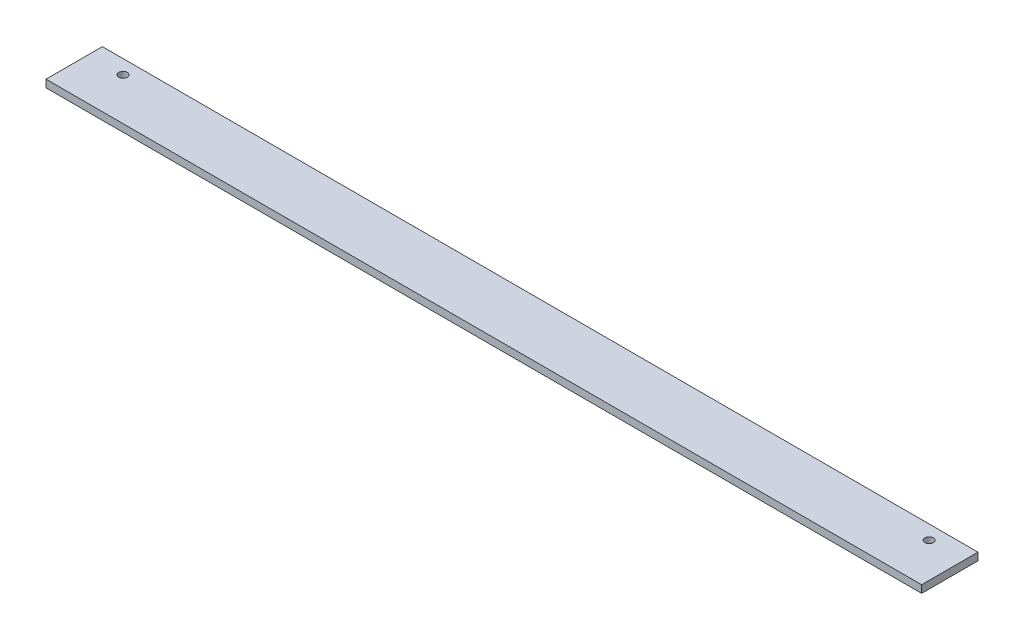
ISO-10303-21;
HEADER;
FILE_DESCRIPTION(('STEP AP214'),'2;1');
FILE_NAME('part.step','',(''),(''),'','','');
FILE_SCHEMA(('AUTOMOTIVE_DESIGN { 1 0 10303 214 1 1 1 1 }'));
ENDSEC;
DATA;
#1=APPLICATION_CONTEXT('core data for automotive mechanical design processes');
#2=APPLICATION_PROTOCOL_DEFINITION('international standard','automotive_design',2000,#1);
#3=PRODUCT_CONTEXT('',#1,'mechanical');
#4=PRODUCT('Part','Part','',(#3));
#5=PRODUCT_RELATED_PRODUCT_CATEGORY('part','',(#4));
#6=PRODUCT_DEFINITION_FORMATION('','',#4);
#7=PRODUCT_DEFINITION_CONTEXT('part definition',#1,'design');
#8=PRODUCT_DEFINITION('design','',#6,#7);
#9=PRODUCT_DEFINITION_SHAPE('','',#8);
#10=(LENGTH_UNIT() NAMED_UNIT(*) SI_UNIT(.MILLI.,.METRE.));
#11=(NAMED_UNIT(*) PLANE_ANGLE_UNIT() SI_UNIT($,.RADIAN.));
#12=(NAMED_UNIT(*) SI_UNIT($,.STERADIAN.) SOLID_ANGLE_UNIT());
#13=UNCERTAINTY_MEASURE_WITH_UNIT(LENGTH_MEASURE(1.E-05),#10,'distance_accuracy_value','');
#14=(GEOMETRIC_REPRESENTATION_CONTEXT(3) GLOBAL_UNCERTAINTY_ASSIGNED_CONTEXT((#13)) GLOBAL_UNIT_ASSIGNED_CONTEXT((#10,
#11,#12)) REPRESENTATION_CONTEXT('',''));
#15=CARTESIAN_POINT('',(0.,0.,0.));
#16=DIRECTION('',(0.,0.,1.));
#17=DIRECTION('',(1.,0.,0.));
#18=AXIS2_PLACEMENT_3D('',#15,#16,#17);
#19=CARTESIAN_POINT('',(466.,-2.,-15.));
#20=DIRECTION('',(0.,0.,1.));
#21=DIRECTION('',(1.,0.,0.));
#22=AXIS2_PLACEMENT_3D('',#19,#20,#21);
#23=PLANE('',#22);
#24=DIRECTION('',(0.,1.,0.));
#25=VECTOR('',#24,1.);
#26=CARTESIAN_POINT('',(0.,-2.,-15.));
#27=LINE('',#26,#25);
#28=CARTESIAN_POINT('',(0.,-2.,-15.));
#29=VERTEX_POINT('',#28);
#30=CARTESIAN_POINT('',(0.,2.,-15.));
#31=VERTEX_POINT('',#30);
#32=EDGE_CURVE('E98',#29,#31,#27,.T.);
#33=ORIENTED_EDGE('',*,*,#32,.T.);
#34=DIRECTION('',(-1.,0.,0.));
#35=VECTOR('',#34,1.);
#36=CARTESIAN_POINT('',(466.,2.,-15.));
#37=LINE('',#36,#35);
#38=CARTESIAN_POINT('',(466.,2.,-15.));
#39=VERTEX_POINT('',#38);
#40=EDGE_CURVE('E11',#39,#31,#37,.T.);
#41=ORIENTED_EDGE('',*,*,#40,.F.);
#42=DIRECTION('',(0.,1.,0.));
#43=VECTOR('',#42,1.);
#44=CARTESIAN_POINT('',(466.,-2.,-15.));
#45=LINE('',#44,#43);
#46=CARTESIAN_POINT('',(466.,-2.,-15.));
#47=VERTEX_POINT('',#46);
#48=EDGE_CURVE('E86',#47,#39,#45,.T.);
#49=ORIENTED_EDGE('',*,*,#48,.F.);
#50=DIRECTION('',(-1.,0.,0.));
#51=VECTOR('',#50,1.);
#52=CARTESIAN_POINT('',(466.,-2.,-15.));
#53=LINE('',#52,#51);
#54=EDGE_CURVE('E94',#47,#29,#53,.T.);
#55=ORIENTED_EDGE('',*,*,#54,.T.);
#56=EDGE_LOOP('',(#33,#41,#49,#55));
#57=FACE_BOUND('',#56,.T.);
#58=ADVANCED_FACE('F35',(#57),#23,.F.);
#59=CARTESIAN_POINT('',(466.,2.,15.));
#60=DIRECTION('',(0.,-1.,0.));
#61=DIRECTION('',(0.,0.,-1.));
#62=AXIS2_PLACEMENT_3D('',#59,#60,#61);
#63=PLANE('',#62);
#64=CARTESIAN_POINT('',(18.5,2.,-7.5));
#65=DIRECTION('',(0.,1.,0.));
#66=DIRECTION('',(0.,0.,1.));
#67=AXIS2_PLACEMENT_3D('',#64,#65,#66);
#68=CIRCLE('',#67,2.25);
#69=CARTESIAN_POINT('',(18.5,2.,-5.25));
#70=VERTEX_POINT('',#69);
#71=EDGE_CURVE('E118',#70,#70,#68,.T.);
#72=ORIENTED_EDGE('',*,*,#71,.F.);
#73=EDGE_LOOP('',(#72));
#74=FACE_BOUND('',#73,.T.);
#75=CARTESIAN_POINT('',(447.5,2.,-7.5));
#76=DIRECTION('',(0.,1.,0.));
#77=DIRECTION('',(0.,0.,1.));
#78=AXIS2_PLACEMENT_3D('',#75,#76,#77);
#79=CIRCLE('',#78,2.24999999999995);
#80=CARTESIAN_POINT('',(447.5,2.,-5.25000000000005));
#81=VERTEX_POINT('',#80);
#82=EDGE_CURVE('E112',#81,#81,#79,.T.);
#83=ORIENTED_EDGE('',*,*,#82,.F.);
#84=EDGE_LOOP('',(#83));
#85=FACE_BOUND('',#84,.T.);
#86=DIRECTION('',(0.,0.,1.));
#87=VECTOR('',#86,1.);
#88=CARTESIAN_POINT('',(0.,2.,15.));
#89=LINE('',#88,#87);
#90=CARTESIAN_POINT('',(0.,2.,15.));
#91=VERTEX_POINT('',#90);
#92=EDGE_CURVE('E90',#31,#91,#89,.T.);
#93=ORIENTED_EDGE('',*,*,#92,.T.);
#94=DIRECTION('',(-1.,0.,0.));
#95=VECTOR('',#94,1.);
#96=CARTESIAN_POINT('',(466.,2.,15.));
#97=LINE('',#96,#95);
#98=CARTESIAN_POINT('',(466.,2.,15.));
#99=VERTEX_POINT('',#98);
#100=EDGE_CURVE('E43',#99,#91,#97,.T.);
#101=ORIENTED_EDGE('',*,*,#100,.F.);
#102=DIRECTION('',(0.,0.,1.));
#103=VECTOR('',#102,1.);
#104=CARTESIAN_POINT('',(466.,2.,15.));
#105=LINE('',#104,#103);
#106=EDGE_CURVE('E81',#39,#99,#105,.T.);
#107=ORIENTED_EDGE('',*,*,#106,.F.);
#108=ORIENTED_EDGE('',*,*,#40,.T.);
#109=EDGE_LOOP('',(#93,#101,#107,#108));
#110=FACE_BOUND('',#109,.T.);
#111=ADVANCED_FACE('F89',(#74,#85,#110),#63,.F.);
#112=CARTESIAN_POINT('',(466.,-2.,15.));
#113=DIRECTION('',(0.,0.,-1.));
#114=DIRECTION('',(-1.,0.,0.));
#115=AXIS2_PLACEMENT_3D('',#112,#113,#114);
#116=PLANE('',#115);
#117=DIRECTION('',(0.,-1.,0.));
#118=VECTOR('',#117,1.);
#119=CARTESIAN_POINT('',(0.,-2.,15.));
#120=LINE('',#119,#118);
#121=CARTESIAN_POINT('',(0.,-2.,15.));
#122=VERTEX_POINT('',#121);
#123=EDGE_CURVE('E68',#91,#122,#120,.T.);
#124=ORIENTED_EDGE('',*,*,#123,.T.);
#125=DIRECTION('',(-1.,0.,0.));
#126=VECTOR('',#125,1.);
#127=CARTESIAN_POINT('',(466.,-2.,15.));
#128=LINE('',#127,#126);
#129=CARTESIAN_POINT('',(466.,-2.,15.));
#130=VERTEX_POINT('',#129);
#131=EDGE_CURVE('E91',#130,#122,#128,.T.);
#132=ORIENTED_EDGE('',*,*,#131,.F.);
#133=DIRECTION('',(0.,-1.,0.));
#134=VECTOR('',#133,1.);
#135=CARTESIAN_POINT('',(466.,-2.,15.));
#136=LINE('',#135,#134);
#137=EDGE_CURVE('E84',#99,#130,#136,.T.);
#138=ORIENTED_EDGE('',*,*,#137,.F.);
#139=ORIENTED_EDGE('',*,*,#100,.T.);
#140=EDGE_LOOP('',(#124,#132,#138,#139));
#141=FACE_BOUND('',#140,.T.);
#142=ADVANCED_FACE('F92',(#141),#116,.F.);
#143=CARTESIAN_POINT('',(466.,-2.,15.));
#144=DIRECTION('',(0.,1.,0.));
#145=DIRECTION('',(0.,0.,1.));
#146=AXIS2_PLACEMENT_3D('',#143,#144,#145);
#147=PLANE('',#146);
#148=CARTESIAN_POINT('',(18.5,-2.,-7.5));
#149=DIRECTION('',(0.,1.,0.));
#150=DIRECTION('',(0.,0.,1.));
#151=AXIS2_PLACEMENT_3D('',#148,#149,#150);
#152=CIRCLE('',#151,2.25);
#153=CARTESIAN_POINT('',(18.5,-2.,-5.25));
#154=VERTEX_POINT('',#153);
#155=EDGE_CURVE('E101',#154,#154,#152,.T.);
#156=ORIENTED_EDGE('',*,*,#155,.T.);
#157=EDGE_LOOP('',(#156));
#158=FACE_BOUND('',#157,.T.);
#159=CARTESIAN_POINT('',(447.5,-2.,-7.5));
#160=DIRECTION('',(0.,1.,0.));
#161=DIRECTION('',(0.,0.,1.));
#162=AXIS2_PLACEMENT_3D('',#159,#160,#161);
#163=CIRCLE('',#162,2.24999999999995);
#164=CARTESIAN_POINT('',(447.5,-2.,-5.25000000000005));
#165=VERTEX_POINT('',#164);
#166=EDGE_CURVE('E115',#165,#165,#163,.T.);
#167=ORIENTED_EDGE('',*,*,#166,.T.);
#168=EDGE_LOOP('',(#167));
#169=FACE_BOUND('',#168,.T.);
#170=DIRECTION('',(0.,0.,-1.));
#171=VECTOR('',#170,1.);
#172=CARTESIAN_POINT('',(0.,-2.,15.));
#173=LINE('',#172,#171);
#174=EDGE_CURVE('E74',#122,#29,#173,.T.);
#175=ORIENTED_EDGE('',*,*,#174,.T.);
#176=ORIENTED_EDGE('',*,*,#54,.F.);
#177=DIRECTION('',(0.,0.,-1.));
#178=VECTOR('',#177,1.);
#179=CARTESIAN_POINT('',(466.,-2.,15.));
#180=LINE('',#179,#178);
#181=EDGE_CURVE('E51',#130,#47,#180,.T.);
#182=ORIENTED_EDGE('',*,*,#181,.F.);
#183=ORIENTED_EDGE('',*,*,#131,.T.);
#184=EDGE_LOOP('',(#175,#176,#182,#183));
#185=FACE_BOUND('',#184,.T.);
#186=ADVANCED_FACE('F106',(#158,#169,#185),#147,.F.);
#187=CARTESIAN_POINT('',(466.,0.,0.));
#188=DIRECTION('',(-1.,0.,0.));
#189=DIRECTION('',(0.,0.,1.));
#190=AXIS2_PLACEMENT_3D('',#187,#188,#189);
#191=PLANE('',#190);
#192=ORIENTED_EDGE('',*,*,#48,.T.);
#193=ORIENTED_EDGE('',*,*,#106,.T.);
#194=ORIENTED_EDGE('',*,*,#137,.T.);
#195=ORIENTED_EDGE('',*,*,#181,.T.);
#196=EDGE_LOOP('',(#192,#193,#194,#195));
#197=FACE_BOUND('',#196,.T.);
#198=ADVANCED_FACE('F82',(#197),#191,.F.);
#199=CARTESIAN_POINT('',(0.,0.,0.));
#200=DIRECTION('',(-1.,0.,0.));
#201=DIRECTION('',(0.,0.,1.));
#202=AXIS2_PLACEMENT_3D('',#199,#200,#201);
#203=PLANE('',#202);
#204=ORIENTED_EDGE('',*,*,#32,.F.);
#205=ORIENTED_EDGE('',*,*,#174,.F.);
#206=ORIENTED_EDGE('',*,*,#123,.F.);
#207=ORIENTED_EDGE('',*,*,#92,.F.);
#208=EDGE_LOOP('',(#204,#205,#206,#207));
#209=FACE_BOUND('',#208,.T.);
#210=ADVANCED_FACE('F109',(#209),#203,.T.);
#211=CARTESIAN_POINT('',(447.5,-2.,-7.5));
#212=DIRECTION('',(0.,1.,0.));
#213=DIRECTION('',(0.,0.,1.));
#214=AXIS2_PLACEMENT_3D('',#211,#212,#213);
#215=CYLINDRICAL_SURFACE('',#214,2.24999999999995);
#216=ORIENTED_EDGE('',*,*,#166,.F.);
#217=EDGE_LOOP('',(#216));
#218=FACE_BOUND('',#217,.T.);
#219=ORIENTED_EDGE('',*,*,#82,.T.);
#220=EDGE_LOOP('',(#219));
#221=FACE_BOUND('',#220,.T.);
#222=ADVANCED_FACE('F129',(#218,#221),#215,.F.);
#223=CARTESIAN_POINT('',(18.5,-2.,-7.5));
#224=DIRECTION('',(0.,1.,0.));
#225=DIRECTION('',(0.,0.,1.));
#226=AXIS2_PLACEMENT_3D('',#223,#224,#225);
#227=CYLINDRICAL_SURFACE('',#226,2.25);
#228=ORIENTED_EDGE('',*,*,#155,.F.);
#229=EDGE_LOOP('',(#228));
#230=FACE_BOUND('',#229,.T.);
#231=ORIENTED_EDGE('',*,*,#71,.T.);
#232=EDGE_LOOP('',(#231));
#233=FACE_BOUND('',#232,.T.);
#234=ADVANCED_FACE('F126',(#230,#233),#227,.F.);
#235=CLOSED_SHELL('',(#58,#111,#142,#186,#198,#210,#222,#234));
#236=MANIFOLD_SOLID_BREP('B2',#235);
#237=ADVANCED_BREP_SHAPE_REPRESENTATION('',(#18,#236),#14);
#238=SHAPE_DEFINITION_REPRESENTATION(#9,#237);
ENDSEC;
END-ISO-10303-21;
